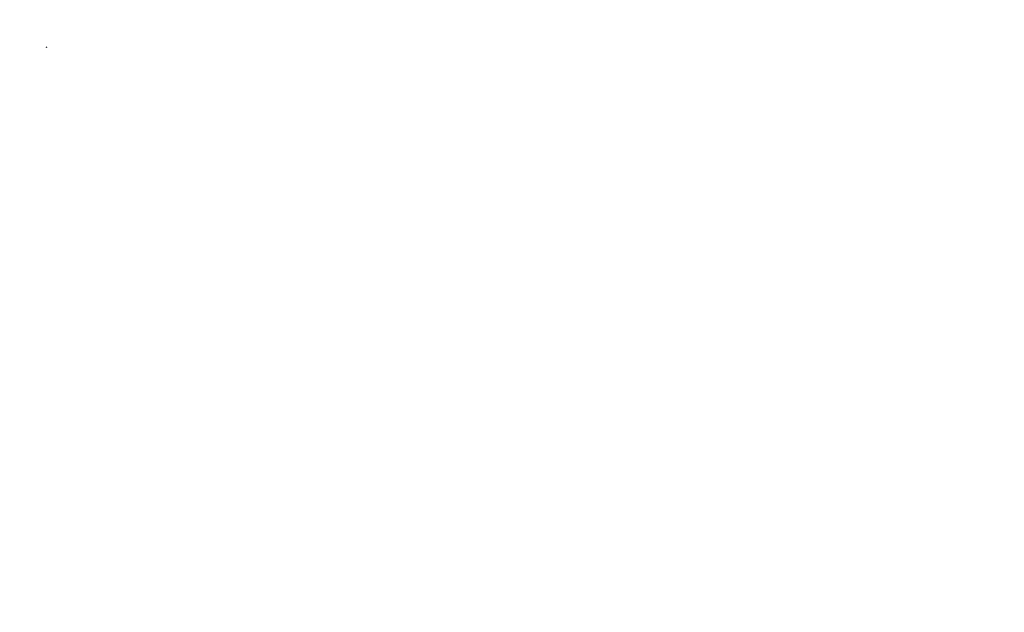
ISO-10303-21;
HEADER;
FILE_DESCRIPTION(('STEP AP214'),'2;1');
FILE_NAME('part.step','',(''),(''),'','','');
FILE_SCHEMA(('AUTOMOTIVE_DESIGN { 1 0 10303 214 1 1 1 1 }'));
ENDSEC;
DATA;
#1=APPLICATION_CONTEXT('core data for automotive mechanical design processes');
#2=APPLICATION_PROTOCOL_DEFINITION('international standard','automotive_design',2000,#1);
#3=PRODUCT_CONTEXT('',#1,'mechanical');
#4=PRODUCT('Part','Part','',(#3));
#5=PRODUCT_RELATED_PRODUCT_CATEGORY('part','',(#4));
#6=PRODUCT_DEFINITION_FORMATION('','',#4);
#7=PRODUCT_DEFINITION_CONTEXT('part definition',#1,'design');
#8=PRODUCT_DEFINITION('design','',#6,#7);
#9=PRODUCT_DEFINITION_SHAPE('','',#8);
#10=(LENGTH_UNIT() NAMED_UNIT(*) SI_UNIT(.MILLI.,.METRE.));
#11=(NAMED_UNIT(*) PLANE_ANGLE_UNIT() SI_UNIT($,.RADIAN.));
#12=(NAMED_UNIT(*) SI_UNIT($,.STERADIAN.) SOLID_ANGLE_UNIT());
#13=UNCERTAINTY_MEASURE_WITH_UNIT(LENGTH_MEASURE(1.E-05),#10,'distance_accuracy_value','');
#14=(GEOMETRIC_REPRESENTATION_CONTEXT(3) GLOBAL_UNCERTAINTY_ASSIGNED_CONTEXT((#13)) GLOBAL_UNIT_ASSIGNED_CONTEXT((#10,
#11,#12)) REPRESENTATION_CONTEXT('',''));
#15=CARTESIAN_POINT('',(0.,0.,0.));
#16=DIRECTION('',(0.,0.,1.));
#17=DIRECTION('',(1.,0.,0.));
#18=AXIS2_PLACEMENT_3D('',#15,#16,#17);
#19=CARTESIAN_POINT('',(35538.41,0.,0.));
#20=DIRECTION('',(0.,0.,-1.));
#21=DIRECTION('',(1.,0.,0.));
#22=AXIS2_PLACEMENT_3D('',#19,#20,#21);
#23=SPHERICAL_SURFACE('',#22,0.3875024);
#24=CARTESIAN_POINT('',(35538.41,0.,-0.3875024));
#25=VERTEX_POINT('',#24);
#26=VERTEX_LOOP('',#25);
#27=FACE_BOUND('',#26,.T.);
#28=ADVANCED_FACE('F39',(#27),#23,.T.);
#29=CLOSED_SHELL('',(#28));
#30=MANIFOLD_SOLID_BREP('B2',#29);
#31=CARTESIAN_POINT('',(22701.0722,0.,0.));
#32=DIRECTION('',(0.,0.,-1.));
#33=DIRECTION('',(1.,0.,0.));
#34=AXIS2_PLACEMENT_3D('',#31,#32,#33);
#35=SPHERICAL_SURFACE('',#34,0.39876729999254);
#36=CARTESIAN_POINT('',(22701.0722,0.,-0.39876729999254));
#37=VERTEX_POINT('',#36);
#38=VERTEX_LOOP('',#37);
#39=FACE_BOUND('',#38,.T.);
#40=ADVANCED_FACE('F57',(#39),#35,.T.);
#41=CLOSED_SHELL('',(#40));
#42=MANIFOLD_SOLID_BREP('B6',#41);
#43=CARTESIAN_POINT('',(11311.94207,0.,0.));
#44=DIRECTION('',(0.,0.,-1.));
#45=DIRECTION('',(1.,0.,0.));
#46=AXIS2_PLACEMENT_3D('',#43,#44,#45);
#47=SPHERICAL_SURFACE('',#46,0.9046083);
#48=CARTESIAN_POINT('',(11311.94207,0.,-0.9046083));
#49=VERTEX_POINT('',#48);
#50=VERTEX_LOOP('',#49);
#51=FACE_BOUND('',#50,.T.);
#52=ADVANCED_FACE('F75',(#51),#47,.T.);
#53=CLOSED_SHELL('',(#52));
#54=MANIFOLD_SOLID_BREP('B35',#53);
#55=CARTESIAN_POINT('',(6143.83836,0.,0.));
#56=DIRECTION('',(0.,0.,-1.));
#57=DIRECTION('',(1.,0.,0.));
#58=AXIS2_PLACEMENT_3D('',#55,#56,#57);
#59=SPHERICAL_SURFACE('',#58,1.0917428);
#60=CARTESIAN_POINT('',(6143.83836,0.,-1.0917428));
#61=VERTEX_POINT('',#60);
#62=VERTEX_LOOP('',#61);
#63=FACE_BOUND('',#62,.T.);
#64=ADVANCED_FACE('F93',(#63),#59,.T.);
#65=CLOSED_SHELL('',(#64));
#66=MANIFOLD_SOLID_BREP('B53',#65);
#67=CARTESIAN_POINT('',(1798.76196,0.,0.));
#68=DIRECTION('',(0.,0.,-1.));
#69=DIRECTION('',(1.,0.,0.));
#70=AXIS2_PLACEMENT_3D('',#67,#68,#69);
#71=SPHERICAL_SURFACE('',#70,0.0534416);
#72=CARTESIAN_POINT('',(1798.76196,0.,-0.0534416));
#73=VERTEX_POINT('',#72);
#74=VERTEX_LOOP('',#73);
#75=FACE_BOUND('',#74,.T.);
#76=ADVANCED_FACE('F111',(#75),#71,.T.);
#77=CLOSED_SHELL('',(#76));
#78=MANIFOLD_SOLID_BREP('B71',#77);
#79=CARTESIAN_POINT('',(1183.5752935,0.,0.));
#80=DIRECTION('',(0.,0.,-1.));
#81=DIRECTION('',(1.,0.,0.));
#82=AXIS2_PLACEMENT_3D('',#79,#80,#81);
#83=SPHERICAL_SURFACE('',#82,0.0274193);
#84=CARTESIAN_POINT('',(1183.5752935,0.,-0.0274193));
#85=VERTEX_POINT('',#84);
#86=VERTEX_LOOP('',#85);
#87=FACE_BOUND('',#86,.T.);
#88=ADVANCED_FACE('F129',(#87),#83,.T.);
#89=CLOSED_SHELL('',(#88));
#90=MANIFOLD_SOLID_BREP('B89',#89);
#91=CARTESIAN_POINT('',(1180.541835,0.,0.));
#92=DIRECTION('',(0.,0.,-1.));
#93=DIRECTION('',(1.,0.,0.));
#94=AXIS2_PLACEMENT_3D('',#91,#92,#93);
#95=SPHERICAL_SURFACE('',#94,0.1005586);
#96=CARTESIAN_POINT('',(1180.541835,0.,-0.1005586));
#97=VERTEX_POINT('',#96);
#98=VERTEX_LOOP('',#97);
#99=FACE_BOUND('',#98,.T.);
#100=ADVANCED_FACE('F147',(#99),#95,.T.);
#101=CLOSED_SHELL('',(#100));
#102=MANIFOLD_SOLID_BREP('B107',#101);
#103=CARTESIAN_POINT('',(853.923489,0.,0.));
#104=DIRECTION('',(0.,0.,-1.));
#105=DIRECTION('',(1.,0.,0.));
#106=AXIS2_PLACEMENT_3D('',#103,#104,#105);
#107=SPHERICAL_SURFACE('',#106,0.0955167);
#108=CARTESIAN_POINT('',(853.923489,0.,-0.0955167));
#109=VERTEX_POINT('',#108);
#110=VERTEX_LOOP('',#109);
#111=FACE_BOUND('',#110,.T.);
#112=ADVANCED_FACE('F165',(#111),#107,.T.);
#113=CLOSED_SHELL('',(#112));
#114=MANIFOLD_SOLID_BREP('B125',#113);
#115=CARTESIAN_POINT('',(456.984354,0.,0.));
#116=DIRECTION('',(0.,0.,-1.));
#117=DIRECTION('',(-1.,0.,0.));
#118=AXIS2_PLACEMENT_3D('',#115,#116,#117);
#119=SPHERICAL_SURFACE('',#118,0.0393573);
#120=CARTESIAN_POINT('',(456.984354,0.,-0.0393573));
#121=VERTEX_POINT('',#120);
#122=VERTEX_LOOP('',#121);
#123=FACE_BOUND('',#122,.T.);
#124=ADVANCED_FACE('F182',(#123),#119,.T.);
#125=CLOSED_SHELL('',(#124));
#126=MANIFOLD_SOLID_BREP('B143',#125);
#127=CARTESIAN_POINT('',(0.,0.,0.));
#128=DIRECTION('',(0.,0.,-1.));
#129=DIRECTION('',(1.,0.,0.));
#130=AXIS2_PLACEMENT_3D('',#127,#128,#129);
#131=SPHERICAL_SURFACE('',#130,10.98423);
#132=CARTESIAN_POINT('',(0.,0.,-10.98423));
#133=VERTEX_POINT('',#132);
#134=VERTEX_LOOP('',#133);
#135=FACE_BOUND('',#134,.T.);
#136=ADVANCED_FACE('F194',(#135),#131,.T.);
#137=CLOSED_SHELL('',(#136));
#138=MANIFOLD_SOLID_BREP('B161',#137);
#139=ADVANCED_BREP_SHAPE_REPRESENTATION('',(#18,#30,#42,#54,#66,#78,#90,#102,#114,#126,#138),#14);
#140=SHAPE_DEFINITION_REPRESENTATION(#9,#139);
ENDSEC;
END-ISO-10303-21;
